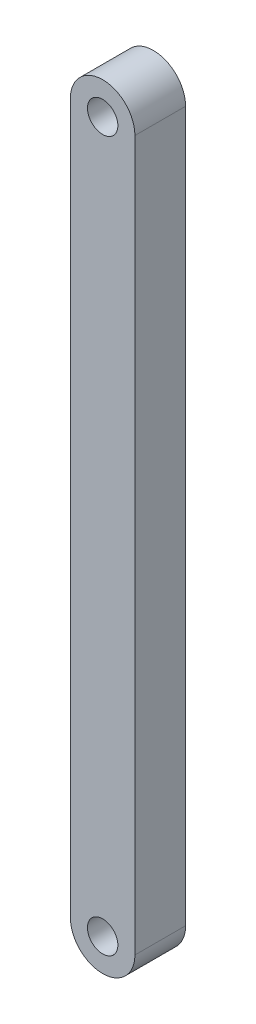
ISO-10303-21;
HEADER;
FILE_DESCRIPTION(('STEP AP214'),'2;1');
FILE_NAME('part.step','',(''),(''),'','','');
FILE_SCHEMA(('AUTOMOTIVE_DESIGN { 1 0 10303 214 1 1 1 1 }'));
ENDSEC;
DATA;
#1=APPLICATION_CONTEXT('core data for automotive mechanical design processes');
#2=APPLICATION_PROTOCOL_DEFINITION('international standard','automotive_design',2000,#1);
#3=PRODUCT_CONTEXT('',#1,'mechanical');
#4=PRODUCT('Part','Part','',(#3));
#5=PRODUCT_RELATED_PRODUCT_CATEGORY('part','',(#4));
#6=PRODUCT_DEFINITION_FORMATION('','',#4);
#7=PRODUCT_DEFINITION_CONTEXT('part definition',#1,'design');
#8=PRODUCT_DEFINITION('design','',#6,#7);
#9=PRODUCT_DEFINITION_SHAPE('','',#8);
#10=(LENGTH_UNIT() NAMED_UNIT(*) SI_UNIT(.MILLI.,.METRE.));
#11=(NAMED_UNIT(*) PLANE_ANGLE_UNIT() SI_UNIT($,.RADIAN.));
#12=(NAMED_UNIT(*) SI_UNIT($,.STERADIAN.) SOLID_ANGLE_UNIT());
#13=UNCERTAINTY_MEASURE_WITH_UNIT(LENGTH_MEASURE(1.E-05),#10,'distance_accuracy_value','');
#14=(GEOMETRIC_REPRESENTATION_CONTEXT(3) GLOBAL_UNCERTAINTY_ASSIGNED_CONTEXT((#13)) GLOBAL_UNIT_ASSIGNED_CONTEXT((#10,
#11,#12)) REPRESENTATION_CONTEXT('',''));
#15=CARTESIAN_POINT('',(0.,0.,0.));
#16=DIRECTION('',(0.,0.,1.));
#17=DIRECTION('',(1.,0.,0.));
#18=AXIS2_PLACEMENT_3D('',#15,#16,#17);
#19=CARTESIAN_POINT('',(0.,-7.00000000000002,1.));
#20=DIRECTION('',(0.,0.,-1.));
#21=DIRECTION('',(-1.,0.,0.));
#22=AXIS2_PLACEMENT_3D('',#19,#20,#21);
#23=CYLINDRICAL_SURFACE('',#22,0.636363636363637);
#24=CARTESIAN_POINT('',(0.,-7.00000000000002,0.));
#25=DIRECTION('',(0.,0.,1.));
#26=DIRECTION('',(1.,0.,0.));
#27=AXIS2_PLACEMENT_3D('',#24,#25,#26);
#28=CIRCLE('',#27,0.636363636363637);
#29=CARTESIAN_POINT('',(-0.636363636363639,-7.00000000000002,0.));
#30=VERTEX_POINT('',#29);
#31=CARTESIAN_POINT('',(0.636363636363639,-7.00000000000002,0.));
#32=VERTEX_POINT('',#31);
#33=EDGE_CURVE('E105',#30,#32,#28,.T.);
#34=ORIENTED_EDGE('',*,*,#33,.T.);
#35=DIRECTION('',(0.,0.,-1.));
#36=VECTOR('',#35,1.);
#37=CARTESIAN_POINT('',(0.636363636363639,-7.00000000000002,1.));
#38=LINE('',#37,#36);
#39=CARTESIAN_POINT('',(0.636363636363639,-7.00000000000002,1.));
#40=VERTEX_POINT('',#39);
#41=EDGE_CURVE('E11',#40,#32,#38,.T.);
#42=ORIENTED_EDGE('',*,*,#41,.F.);
#43=CARTESIAN_POINT('',(0.,-7.00000000000002,1.));
#44=DIRECTION('',(0.,0.,1.));
#45=DIRECTION('',(1.,0.,0.));
#46=AXIS2_PLACEMENT_3D('',#43,#44,#45);
#47=CIRCLE('',#46,0.636363636363637);
#48=CARTESIAN_POINT('',(-0.636363636363639,-7.00000000000002,1.));
#49=VERTEX_POINT('',#48);
#50=EDGE_CURVE('E76',#49,#40,#47,.T.);
#51=ORIENTED_EDGE('',*,*,#50,.F.);
#52=DIRECTION('',(0.,0.,-1.));
#53=VECTOR('',#52,1.);
#54=CARTESIAN_POINT('',(-0.636363636363639,-7.00000000000002,1.));
#55=LINE('',#54,#53);
#56=EDGE_CURVE('E104',#49,#30,#55,.T.);
#57=ORIENTED_EDGE('',*,*,#56,.T.);
#58=EDGE_LOOP('',(#34,#42,#51,#57));
#59=FACE_BOUND('',#58,.T.);
#60=ADVANCED_FACE('F34',(#59),#23,.T.);
#61=CARTESIAN_POINT('',(0.636363636363638,0.,1.));
#62=DIRECTION('',(1.,0.,0.));
#63=DIRECTION('',(0.,1.,0.));
#64=AXIS2_PLACEMENT_3D('',#61,#62,#63);
#65=PLANE('',#64);
#66=DIRECTION('',(0.,-1.,0.));
#67=VECTOR('',#66,1.);
#68=CARTESIAN_POINT('',(0.636363636363638,0.,0.));
#69=LINE('',#68,#67);
#70=CARTESIAN_POINT('',(0.636363636363637,6.99999999999999,0.));
#71=VERTEX_POINT('',#70);
#72=EDGE_CURVE('E86',#71,#32,#69,.T.);
#73=ORIENTED_EDGE('',*,*,#72,.F.);
#74=DIRECTION('',(0.,0.,-1.));
#75=VECTOR('',#74,1.);
#76=CARTESIAN_POINT('',(0.636363636363637,6.99999999999999,1.));
#77=LINE('',#76,#75);
#78=CARTESIAN_POINT('',(0.636363636363637,6.99999999999999,1.));
#79=VERTEX_POINT('',#78);
#80=EDGE_CURVE('E42',#79,#71,#77,.T.);
#81=ORIENTED_EDGE('',*,*,#80,.F.);
#82=DIRECTION('',(0.,-1.,0.));
#83=VECTOR('',#82,1.);
#84=CARTESIAN_POINT('',(0.636363636363638,0.,1.));
#85=LINE('',#84,#83);
#86=EDGE_CURVE('E84',#79,#40,#85,.T.);
#87=ORIENTED_EDGE('',*,*,#86,.T.);
#88=ORIENTED_EDGE('',*,*,#41,.T.);
#89=EDGE_LOOP('',(#73,#81,#87,#88));
#90=FACE_BOUND('',#89,.T.);
#91=ADVANCED_FACE('F83',(#90),#65,.T.);
#92=CARTESIAN_POINT('',(0.,6.99999999999999,1.));
#93=DIRECTION('',(0.,0.,-1.));
#94=DIRECTION('',(-1.,0.,0.));
#95=AXIS2_PLACEMENT_3D('',#92,#93,#94);
#96=CYLINDRICAL_SURFACE('',#95,0.636363636363639);
#97=CARTESIAN_POINT('',(0.,6.99999999999999,0.));
#98=DIRECTION('',(0.,0.,1.));
#99=DIRECTION('',(1.,0.,0.));
#100=AXIS2_PLACEMENT_3D('',#97,#98,#99);
#101=CIRCLE('',#100,0.636363636363639);
#102=CARTESIAN_POINT('',(-0.636363636363637,6.99999999999999,0.));
#103=VERTEX_POINT('',#102);
#104=EDGE_CURVE('E65',#71,#103,#101,.T.);
#105=ORIENTED_EDGE('',*,*,#104,.T.);
#106=DIRECTION('',(0.,0.,-1.));
#107=VECTOR('',#106,1.);
#108=CARTESIAN_POINT('',(-0.636363636363637,6.99999999999999,1.));
#109=LINE('',#108,#107);
#110=CARTESIAN_POINT('',(-0.636363636363637,6.99999999999999,1.));
#111=VERTEX_POINT('',#110);
#112=EDGE_CURVE('E87',#111,#103,#109,.T.);
#113=ORIENTED_EDGE('',*,*,#112,.F.);
#114=CARTESIAN_POINT('',(0.,6.99999999999999,1.));
#115=DIRECTION('',(0.,0.,1.));
#116=DIRECTION('',(1.,0.,0.));
#117=AXIS2_PLACEMENT_3D('',#114,#115,#116);
#118=CIRCLE('',#117,0.636363636363639);
#119=EDGE_CURVE('E88',#79,#111,#118,.T.);
#120=ORIENTED_EDGE('',*,*,#119,.F.);
#121=ORIENTED_EDGE('',*,*,#80,.T.);
#122=EDGE_LOOP('',(#105,#113,#120,#121));
#123=FACE_BOUND('',#122,.T.);
#124=ADVANCED_FACE('F89',(#123),#96,.T.);
#125=CARTESIAN_POINT('',(0.,-7.00000000000002,1.));
#126=DIRECTION('',(0.,0.,-1.));
#127=DIRECTION('',(-1.,0.,0.));
#128=AXIS2_PLACEMENT_3D('',#125,#126,#127);
#129=CYLINDRICAL_SURFACE('',#128,0.3);
#130=CARTESIAN_POINT('',(0.,-7.00000000000002,1.));
#131=DIRECTION('',(0.,0.,1.));
#132=DIRECTION('',(1.,0.,0.));
#133=AXIS2_PLACEMENT_3D('',#130,#131,#132);
#134=CIRCLE('',#133,0.3);
#135=CARTESIAN_POINT('',(0.300000000000002,-7.00000000000002,1.));
#136=VERTEX_POINT('',#135);
#137=EDGE_CURVE('E98',#136,#136,#134,.T.);
#138=ORIENTED_EDGE('',*,*,#137,.T.);
#139=EDGE_LOOP('',(#138));
#140=FACE_BOUND('',#139,.T.);
#141=CARTESIAN_POINT('',(0.,-7.00000000000002,0.));
#142=DIRECTION('',(0.,0.,1.));
#143=DIRECTION('',(1.,0.,0.));
#144=AXIS2_PLACEMENT_3D('',#141,#142,#143);
#145=CIRCLE('',#144,0.3);
#146=CARTESIAN_POINT('',(0.300000000000002,-7.00000000000002,0.));
#147=VERTEX_POINT('',#146);
#148=EDGE_CURVE('E111',#147,#147,#145,.T.);
#149=ORIENTED_EDGE('',*,*,#148,.F.);
#150=EDGE_LOOP('',(#149));
#151=FACE_BOUND('',#150,.T.);
#152=ADVANCED_FACE('F130',(#140,#151),#129,.F.);
#153=CARTESIAN_POINT('',(-0.636363636363638,0.,1.));
#154=DIRECTION('',(1.,0.,0.));
#155=DIRECTION('',(0.,1.,0.));
#156=AXIS2_PLACEMENT_3D('',#153,#154,#155);
#157=PLANE('',#156);
#158=DIRECTION('',(0.,-1.,0.));
#159=VECTOR('',#158,1.);
#160=CARTESIAN_POINT('',(-0.636363636363638,0.,0.));
#161=LINE('',#160,#159);
#162=EDGE_CURVE('E71',#103,#30,#161,.T.);
#163=ORIENTED_EDGE('',*,*,#162,.T.);
#164=ORIENTED_EDGE('',*,*,#56,.F.);
#165=DIRECTION('',(0.,-1.,0.));
#166=VECTOR('',#165,1.);
#167=CARTESIAN_POINT('',(-0.636363636363638,0.,1.));
#168=LINE('',#167,#166);
#169=EDGE_CURVE('E50',#111,#49,#168,.T.);
#170=ORIENTED_EDGE('',*,*,#169,.F.);
#171=ORIENTED_EDGE('',*,*,#112,.T.);
#172=EDGE_LOOP('',(#163,#164,#170,#171));
#173=FACE_BOUND('',#172,.T.);
#174=ADVANCED_FACE('F117',(#173),#157,.F.);
#175=CARTESIAN_POINT('',(0.,6.99999999999999,1.));
#176=DIRECTION('',(0.,0.,-1.));
#177=DIRECTION('',(-1.,0.,0.));
#178=AXIS2_PLACEMENT_3D('',#175,#176,#177);
#179=CYLINDRICAL_SURFACE('',#178,0.3);
#180=CARTESIAN_POINT('',(0.,6.99999999999999,1.));
#181=DIRECTION('',(0.,0.,1.));
#182=DIRECTION('',(1.,0.,0.));
#183=AXIS2_PLACEMENT_3D('',#180,#181,#182);
#184=CIRCLE('',#183,0.3);
#185=CARTESIAN_POINT('',(0.299999999999998,6.99999999999999,1.));
#186=VERTEX_POINT('',#185);
#187=EDGE_CURVE('E101',#186,#186,#184,.T.);
#188=ORIENTED_EDGE('',*,*,#187,.T.);
#189=EDGE_LOOP('',(#188));
#190=FACE_BOUND('',#189,.T.);
#191=CARTESIAN_POINT('',(0.,6.99999999999999,0.));
#192=DIRECTION('',(0.,0.,1.));
#193=DIRECTION('',(1.,0.,0.));
#194=AXIS2_PLACEMENT_3D('',#191,#192,#193);
#195=CIRCLE('',#194,0.3);
#196=CARTESIAN_POINT('',(0.299999999999998,6.99999999999999,0.));
#197=VERTEX_POINT('',#196);
#198=EDGE_CURVE('E94',#197,#197,#195,.T.);
#199=ORIENTED_EDGE('',*,*,#198,.F.);
#200=EDGE_LOOP('',(#199));
#201=FACE_BOUND('',#200,.T.);
#202=ADVANCED_FACE('F135',(#190,#201),#179,.F.);
#203=CARTESIAN_POINT('',(0.,0.,1.));
#204=DIRECTION('',(0.,0.,1.));
#205=DIRECTION('',(1.,0.,0.));
#206=AXIS2_PLACEMENT_3D('',#203,#204,#205);
#207=PLANE('',#206);
#208=ORIENTED_EDGE('',*,*,#50,.T.);
#209=ORIENTED_EDGE('',*,*,#86,.F.);
#210=ORIENTED_EDGE('',*,*,#119,.T.);
#211=ORIENTED_EDGE('',*,*,#169,.T.);
#212=EDGE_LOOP('',(#208,#209,#210,#211));
#213=FACE_BOUND('',#212,.T.);
#214=ORIENTED_EDGE('',*,*,#137,.F.);
#215=EDGE_LOOP('',(#214));
#216=FACE_BOUND('',#215,.T.);
#217=ORIENTED_EDGE('',*,*,#187,.F.);
#218=EDGE_LOOP('',(#217));
#219=FACE_BOUND('',#218,.T.);
#220=ADVANCED_FACE('F91',(#213,#216,#219),#207,.T.);
#221=CARTESIAN_POINT('',(0.,0.,0.));
#222=DIRECTION('',(0.,0.,1.));
#223=DIRECTION('',(1.,0.,0.));
#224=AXIS2_PLACEMENT_3D('',#221,#222,#223);
#225=PLANE('',#224);
#226=ORIENTED_EDGE('',*,*,#33,.F.);
#227=ORIENTED_EDGE('',*,*,#162,.F.);
#228=ORIENTED_EDGE('',*,*,#104,.F.);
#229=ORIENTED_EDGE('',*,*,#72,.T.);
#230=EDGE_LOOP('',(#226,#227,#228,#229));
#231=FACE_BOUND('',#230,.T.);
#232=ORIENTED_EDGE('',*,*,#148,.T.);
#233=EDGE_LOOP('',(#232));
#234=FACE_BOUND('',#233,.T.);
#235=ORIENTED_EDGE('',*,*,#198,.T.);
#236=EDGE_LOOP('',(#235));
#237=FACE_BOUND('',#236,.T.);
#238=ADVANCED_FACE('F120',(#231,#234,#237),#225,.F.);
#239=CLOSED_SHELL('',(#60,#91,#124,#152,#174,#202,#220,#238));
#240=MANIFOLD_SOLID_BREP('B2',#239);
#241=ADVANCED_BREP_SHAPE_REPRESENTATION('',(#18,#240),#14);
#242=SHAPE_DEFINITION_REPRESENTATION(#9,#241);
ENDSEC;
END-ISO-10303-21;
